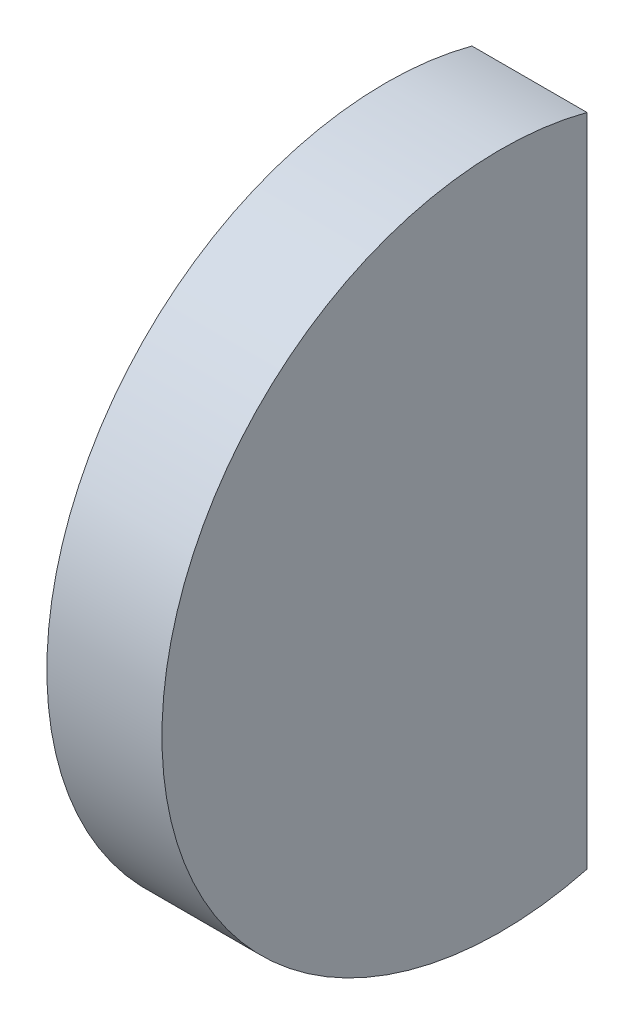
ISO-10303-21;
HEADER;
FILE_DESCRIPTION(('STEP AP214'),'2;1');
FILE_NAME('part.step','',(''),(''),'','','');
FILE_SCHEMA(('AUTOMOTIVE_DESIGN { 1 0 10303 214 1 1 1 1 }'));
ENDSEC;
DATA;
#1=APPLICATION_CONTEXT('core data for automotive mechanical design processes');
#2=APPLICATION_PROTOCOL_DEFINITION('international standard','automotive_design',2000,#1);
#3=PRODUCT_CONTEXT('',#1,'mechanical');
#4=PRODUCT('Part','Part','',(#3));
#5=PRODUCT_RELATED_PRODUCT_CATEGORY('part','',(#4));
#6=PRODUCT_DEFINITION_FORMATION('','',#4);
#7=PRODUCT_DEFINITION_CONTEXT('part definition',#1,'design');
#8=PRODUCT_DEFINITION('design','',#6,#7);
#9=PRODUCT_DEFINITION_SHAPE('','',#8);
#10=(LENGTH_UNIT() NAMED_UNIT(*) SI_UNIT(.MILLI.,.METRE.));
#11=(NAMED_UNIT(*) PLANE_ANGLE_UNIT() SI_UNIT($,.RADIAN.));
#12=(NAMED_UNIT(*) SI_UNIT($,.STERADIAN.) SOLID_ANGLE_UNIT());
#13=UNCERTAINTY_MEASURE_WITH_UNIT(LENGTH_MEASURE(1.E-05),#10,'distance_accuracy_value','');
#14=(GEOMETRIC_REPRESENTATION_CONTEXT(3) GLOBAL_UNCERTAINTY_ASSIGNED_CONTEXT((#13)) GLOBAL_UNIT_ASSIGNED_CONTEXT((#10,
#11,#12)) REPRESENTATION_CONTEXT('',''));
#15=CARTESIAN_POINT('',(0.,0.,0.));
#16=DIRECTION('',(0.,0.,1.));
#17=DIRECTION('',(1.,0.,0.));
#18=AXIS2_PLACEMENT_3D('',#15,#16,#17);
#19=CARTESIAN_POINT('',(48.5,0.,0.));
#20=DIRECTION('',(-1.,0.,0.));
#21=DIRECTION('',(0.,1.,0.));
#22=AXIS2_PLACEMENT_3D('',#19,#20,#21);
#23=SPHERICAL_SURFACE('',#22,48.5);
#24=CARTESIAN_POINT('',(1.26389093077204,0.,0.));
#25=DIRECTION('',(-1.,0.,0.));
#26=DIRECTION('',(0.,0.,1.));
#27=AXIS2_PLACEMENT_3D('',#24,#25,#26);
#28=CIRCLE('',#27,11.);
#29=CARTESIAN_POINT('',(1.26389093077204,-10.6376689175778,-2.8));
#30=VERTEX_POINT('',#29);
#31=CARTESIAN_POINT('',(1.26389093077204,10.6376689175778,-2.8));
#32=VERTEX_POINT('',#31);
#33=EDGE_CURVE('E11',#30,#32,#28,.T.);
#34=ORIENTED_EDGE('',*,*,#33,.T.);
#35=CARTESIAN_POINT('',(48.5,0.,-2.8));
#36=DIRECTION('',(0.,0.,1.));
#37=DIRECTION('',(1.,0.,0.));
#38=AXIS2_PLACEMENT_3D('',#35,#36,#37);
#39=CIRCLE('',#38,48.4191077984715);
#40=EDGE_CURVE('E63',#32,#30,#39,.T.);
#41=ORIENTED_EDGE('',*,*,#40,.T.);
#42=EDGE_LOOP('',(#34,#41));
#43=FACE_BOUND('',#42,.T.);
#44=ADVANCED_FACE('F30',(#43),#23,.T.);
#45=CARTESIAN_POINT('',(0.,0.,0.));
#46=DIRECTION('',(-1.,0.,0.));
#47=DIRECTION('',(0.,0.,1.));
#48=AXIS2_PLACEMENT_3D('',#45,#46,#47);
#49=CYLINDRICAL_SURFACE('',#48,11.);
#50=CARTESIAN_POINT('',(5.,0.,0.));
#51=DIRECTION('',(-1.,0.,0.));
#52=DIRECTION('',(0.,0.,1.));
#53=AXIS2_PLACEMENT_3D('',#50,#51,#52);
#54=CIRCLE('',#53,11.);
#55=CARTESIAN_POINT('',(5.,-10.6376689175778,-2.8));
#56=VERTEX_POINT('',#55);
#57=CARTESIAN_POINT('',(5.,10.6376689175778,-2.8));
#58=VERTEX_POINT('',#57);
#59=EDGE_CURVE('E37',#56,#58,#54,.T.);
#60=ORIENTED_EDGE('',*,*,#59,.T.);
#61=DIRECTION('',(1.,0.,0.));
#62=VECTOR('',#61,1.);
#63=CARTESIAN_POINT('',(0.,10.6376689175778,-2.8));
#64=LINE('',#63,#62);
#65=EDGE_CURVE('E44',#32,#58,#64,.T.);
#66=ORIENTED_EDGE('',*,*,#65,.F.);
#67=ORIENTED_EDGE('',*,*,#33,.F.);
#68=DIRECTION('',(1.,0.,0.));
#69=VECTOR('',#68,1.);
#70=CARTESIAN_POINT('',(0.,-10.6376689175778,-2.8));
#71=LINE('',#70,#69);
#72=EDGE_CURVE('E49',#30,#56,#71,.T.);
#73=ORIENTED_EDGE('',*,*,#72,.T.);
#74=EDGE_LOOP('',(#60,#66,#67,#73));
#75=FACE_BOUND('',#74,.T.);
#76=ADVANCED_FACE('F62',(#75),#49,.T.);
#77=CARTESIAN_POINT('',(5.,11.,0.));
#78=DIRECTION('',(-1.,0.,0.));
#79=DIRECTION('',(0.,0.,1.));
#80=AXIS2_PLACEMENT_3D('',#77,#78,#79);
#81=PLANE('',#80);
#82=ORIENTED_EDGE('',*,*,#59,.F.);
#83=DIRECTION('',(0.,-1.,0.));
#84=VECTOR('',#83,1.);
#85=CARTESIAN_POINT('',(5.,0.,-2.8));
#86=LINE('',#85,#84);
#87=EDGE_CURVE('E54',#58,#56,#86,.T.);
#88=ORIENTED_EDGE('',*,*,#87,.F.);
#89=EDGE_LOOP('',(#82,#88));
#90=FACE_BOUND('',#89,.T.);
#91=ADVANCED_FACE('F65',(#90),#81,.F.);
#92=CARTESIAN_POINT('',(0.,0.,-2.8));
#93=DIRECTION('',(0.,0.,1.));
#94=DIRECTION('',(1.,0.,0.));
#95=AXIS2_PLACEMENT_3D('',#92,#93,#94);
#96=PLANE('',#95);
#97=ORIENTED_EDGE('',*,*,#65,.T.);
#98=ORIENTED_EDGE('',*,*,#87,.T.);
#99=ORIENTED_EDGE('',*,*,#72,.F.);
#100=ORIENTED_EDGE('',*,*,#40,.F.);
#101=EDGE_LOOP('',(#97,#98,#99,#100));
#102=FACE_BOUND('',#101,.T.);
#103=ADVANCED_FACE('F55',(#102),#96,.F.);
#104=CLOSED_SHELL('',(#44,#76,#91,#103));
#105=MANIFOLD_SOLID_BREP('B2',#104);
#106=ADVANCED_BREP_SHAPE_REPRESENTATION('',(#18,#105),#14);
#107=SHAPE_DEFINITION_REPRESENTATION(#9,#106);
ENDSEC;
END-ISO-10303-21;
